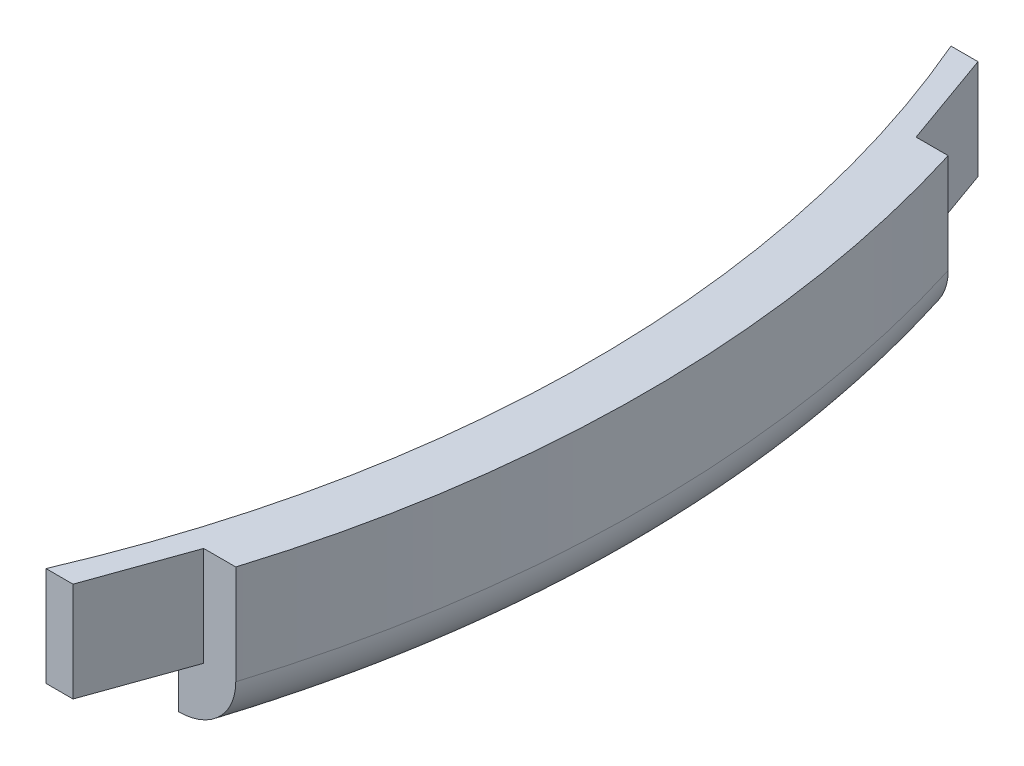
ISO-10303-21;
HEADER;
FILE_DESCRIPTION(('STEP AP214'),'2;1');
FILE_NAME('part.step','',(''),(''),'','','');
FILE_SCHEMA(('AUTOMOTIVE_DESIGN { 1 0 10303 214 1 1 1 1 }'));
ENDSEC;
DATA;
#1=APPLICATION_CONTEXT('core data for automotive mechanical design processes');
#2=APPLICATION_PROTOCOL_DEFINITION('international standard','automotive_design',2000,#1);
#3=PRODUCT_CONTEXT('',#1,'mechanical');
#4=PRODUCT('Part','Part','',(#3));
#5=PRODUCT_RELATED_PRODUCT_CATEGORY('part','',(#4));
#6=PRODUCT_DEFINITION_FORMATION('','',#4);
#7=PRODUCT_DEFINITION_CONTEXT('part definition',#1,'design');
#8=PRODUCT_DEFINITION('design','',#6,#7);
#9=PRODUCT_DEFINITION_SHAPE('','',#8);
#10=(LENGTH_UNIT() NAMED_UNIT(*) SI_UNIT(.MILLI.,.METRE.));
#11=(NAMED_UNIT(*) PLANE_ANGLE_UNIT() SI_UNIT($,.RADIAN.));
#12=(NAMED_UNIT(*) SI_UNIT($,.STERADIAN.) SOLID_ANGLE_UNIT());
#13=UNCERTAINTY_MEASURE_WITH_UNIT(LENGTH_MEASURE(1.E-05),#10,'distance_accuracy_value','');
#14=(GEOMETRIC_REPRESENTATION_CONTEXT(3) GLOBAL_UNCERTAINTY_ASSIGNED_CONTEXT((#13)) GLOBAL_UNIT_ASSIGNED_CONTEXT((#10,
#11,#12)) REPRESENTATION_CONTEXT('',''));
#15=CARTESIAN_POINT('',(0.,0.,0.));
#16=DIRECTION('',(0.,0.,1.));
#17=DIRECTION('',(1.,0.,0.));
#18=AXIS2_PLACEMENT_3D('',#15,#16,#17);
#19=CARTESIAN_POINT('',(32.9063823596578,3.6,14.1));
#20=DIRECTION('',(0.,0.,-1.));
#21=DIRECTION('',(-1.,0.,0.));
#22=AXIS2_PLACEMENT_3D('',#19,#20,#21);
#23=PLANE('',#22);
#24=DIRECTION('',(-1.,0.,0.));
#25=VECTOR('',#24,1.);
#26=CARTESIAN_POINT('',(33.7482373653686,0.5,14.1));
#27=LINE('',#26,#25);
#28=CARTESIAN_POINT('',(33.7482373653686,0.5,14.1));
#29=VERTEX_POINT('',#28);
#30=CARTESIAN_POINT('',(32.9063823596578,0.5,14.1));
#31=VERTEX_POINT('',#30);
#32=EDGE_CURVE('E134',#29,#31,#27,.T.);
#33=ORIENTED_EDGE('',*,*,#32,.F.);
#34=DIRECTION('',(0.,-1.,0.));
#35=VECTOR('',#34,1.);
#36=CARTESIAN_POINT('',(33.7482373653686,3.6,14.1));
#37=LINE('',#36,#35);
#38=CARTESIAN_POINT('',(33.7482373653686,3.6,14.1));
#39=VERTEX_POINT('',#38);
#40=EDGE_CURVE('E151',#39,#29,#37,.T.);
#41=ORIENTED_EDGE('',*,*,#40,.F.);
#42=DIRECTION('',(1.,0.,0.));
#43=VECTOR('',#42,1.);
#44=CARTESIAN_POINT('',(32.9063823596578,3.6,14.1));
#45=LINE('',#44,#43);
#46=CARTESIAN_POINT('',(32.9063823596578,3.6,14.1));
#47=VERTEX_POINT('',#46);
#48=EDGE_CURVE('E209',#47,#39,#45,.T.);
#49=ORIENTED_EDGE('',*,*,#48,.F.);
#50=DIRECTION('',(0.,-1.,0.));
#51=VECTOR('',#50,1.);
#52=CARTESIAN_POINT('',(32.9063823596578,3.6,14.1));
#53=LINE('',#52,#51);
#54=EDGE_CURVE('E154',#47,#31,#53,.T.);
#55=ORIENTED_EDGE('',*,*,#54,.T.);
#56=EDGE_LOOP('',(#33,#41,#49,#55));
#57=FACE_BOUND('',#56,.T.);
#58=ADVANCED_FACE('F34',(#57),#23,.F.);
#59=CARTESIAN_POINT('',(33.7482373653686,3.6,14.1));
#60=DIRECTION('',(-0.941753663860035,0.,-0.336303488840363));
#61=DIRECTION('',(-0.336303488840363,0.,0.941753663860035));
#62=AXIS2_PLACEMENT_3D('',#59,#60,#61);
#63=PLANE('',#62);
#64=DIRECTION('',(-0.336303488840363,0.,0.941753663860035));
#65=VECTOR('',#64,1.);
#66=CARTESIAN_POINT('',(34.8195477358383,0.5,11.1));
#67=LINE('',#66,#65);
#68=CARTESIAN_POINT('',(34.8195477358383,0.5,11.1));
#69=VERTEX_POINT('',#68);
#70=EDGE_CURVE('E199',#69,#29,#67,.T.);
#71=ORIENTED_EDGE('',*,*,#70,.F.);
#72=DIRECTION('',(0.,-1.,0.));
#73=VECTOR('',#72,1.);
#74=CARTESIAN_POINT('',(34.8195477358383,3.6,11.1));
#75=LINE('',#74,#73);
#76=CARTESIAN_POINT('',(34.8195477358383,3.6,11.1));
#77=VERTEX_POINT('',#76);
#78=EDGE_CURVE('E148',#77,#69,#75,.T.);
#79=ORIENTED_EDGE('',*,*,#78,.F.);
#80=DIRECTION('',(0.336303488840363,0.,-0.941753663860035));
#81=VECTOR('',#80,1.);
#82=CARTESIAN_POINT('',(33.7482373653686,3.6,14.1));
#83=LINE('',#82,#81);
#84=EDGE_CURVE('E211',#39,#77,#83,.T.);
#85=ORIENTED_EDGE('',*,*,#84,.F.);
#86=ORIENTED_EDGE('',*,*,#40,.T.);
#87=EDGE_LOOP('',(#71,#79,#85,#86));
#88=FACE_BOUND('',#87,.T.);
#89=ADVANCED_FACE('F171',(#88),#63,.F.);
#90=CARTESIAN_POINT('',(33.7482373653686,3.6,-14.1));
#91=DIRECTION('',(-0.941753663860035,0.,0.336303488840363));
#92=DIRECTION('',(0.336303488840363,0.,0.941753663860035));
#93=AXIS2_PLACEMENT_3D('',#90,#91,#92);
#94=PLANE('',#93);
#95=DIRECTION('',(0.336303488840363,0.,0.941753663860035));
#96=VECTOR('',#95,1.);
#97=CARTESIAN_POINT('',(33.7482373653686,0.5,-14.1));
#98=LINE('',#97,#96);
#99=CARTESIAN_POINT('',(33.7482373653686,0.5,-14.1));
#100=VERTEX_POINT('',#99);
#101=CARTESIAN_POINT('',(34.8195477358383,0.5,-11.1));
#102=VERTEX_POINT('',#101);
#103=EDGE_CURVE('E126',#100,#102,#98,.T.);
#104=ORIENTED_EDGE('',*,*,#103,.F.);
#105=DIRECTION('',(0.,-1.,0.));
#106=VECTOR('',#105,1.);
#107=CARTESIAN_POINT('',(33.7482373653686,3.6,-14.1));
#108=LINE('',#107,#106);
#109=CARTESIAN_POINT('',(33.7482373653686,3.6,-14.1));
#110=VERTEX_POINT('',#109);
#111=EDGE_CURVE('E139',#110,#100,#108,.T.);
#112=ORIENTED_EDGE('',*,*,#111,.F.);
#113=DIRECTION('',(-0.336303488840363,0.,-0.941753663860035));
#114=VECTOR('',#113,1.);
#115=CARTESIAN_POINT('',(33.7482373653686,3.6,-14.1));
#116=LINE('',#115,#114);
#117=CARTESIAN_POINT('',(34.8195477358383,3.6,-11.1));
#118=VERTEX_POINT('',#117);
#119=EDGE_CURVE('E137',#118,#110,#116,.T.);
#120=ORIENTED_EDGE('',*,*,#119,.F.);
#121=DIRECTION('',(0.,-1.,0.));
#122=VECTOR('',#121,1.);
#123=CARTESIAN_POINT('',(34.8195477358383,3.6,-11.1));
#124=LINE('',#123,#122);
#125=EDGE_CURVE('E122',#118,#102,#124,.T.);
#126=ORIENTED_EDGE('',*,*,#125,.T.);
#127=EDGE_LOOP('',(#104,#112,#120,#126));
#128=FACE_BOUND('',#127,.T.);
#129=ADVANCED_FACE('F136',(#128),#94,.F.);
#130=CARTESIAN_POINT('',(32.9063823596578,3.6,-14.1));
#131=DIRECTION('',(0.,0.,1.));
#132=DIRECTION('',(1.,0.,0.));
#133=AXIS2_PLACEMENT_3D('',#130,#131,#132);
#134=PLANE('',#133);
#135=DIRECTION('',(1.,0.,0.));
#136=VECTOR('',#135,1.);
#137=CARTESIAN_POINT('',(32.9063823596578,0.5,-14.1));
#138=LINE('',#137,#136);
#139=CARTESIAN_POINT('',(32.9063823596578,0.5,-14.1));
#140=VERTEX_POINT('',#139);
#141=EDGE_CURVE('E130',#140,#100,#138,.T.);
#142=ORIENTED_EDGE('',*,*,#141,.F.);
#143=DIRECTION('',(0.,-1.,0.));
#144=VECTOR('',#143,1.);
#145=CARTESIAN_POINT('',(32.9063823596578,3.6,-14.1));
#146=LINE('',#145,#144);
#147=CARTESIAN_POINT('',(32.9063823596578,3.6,-14.1));
#148=VERTEX_POINT('',#147);
#149=EDGE_CURVE('E143',#148,#140,#146,.T.);
#150=ORIENTED_EDGE('',*,*,#149,.F.);
#151=DIRECTION('',(-1.,0.,0.));
#152=VECTOR('',#151,1.);
#153=CARTESIAN_POINT('',(32.9063823596578,3.6,-14.1));
#154=LINE('',#153,#152);
#155=EDGE_CURVE('E220',#110,#148,#154,.T.);
#156=ORIENTED_EDGE('',*,*,#155,.F.);
#157=ORIENTED_EDGE('',*,*,#111,.T.);
#158=EDGE_LOOP('',(#142,#150,#156,#157));
#159=FACE_BOUND('',#158,.T.);
#160=ADVANCED_FACE('F178',(#159),#134,.F.);
#161=CARTESIAN_POINT('',(0.,3.6,0.));
#162=DIRECTION('',(0.,-1.,0.));
#163=DIRECTION('',(0.,0.,-1.));
#164=AXIS2_PLACEMENT_3D('',#161,#162,#163);
#165=CYLINDRICAL_SURFACE('',#164,35.8);
#166=CARTESIAN_POINT('',(0.,0.5,0.));
#167=DIRECTION('',(0.,1.,0.));
#168=DIRECTION('',(0.,0.,-1.));
#169=AXIS2_PLACEMENT_3D('',#166,#167,#168);
#170=CIRCLE('',#169,35.8);
#171=CARTESIAN_POINT('',(34.0357165342527,0.5,-11.1));
#172=VERTEX_POINT('',#171);
#173=EDGE_CURVE('E55',#172,#140,#170,.T.);
#174=ORIENTED_EDGE('',*,*,#173,.F.);
#175=DIRECTION('',(0.,1.,0.));
#176=VECTOR('',#175,1.);
#177=CARTESIAN_POINT('',(34.0357165342527,-1.2,-11.1));
#178=LINE('',#177,#176);
#179=CARTESIAN_POINT('',(34.0357165342527,-1.2,-11.1));
#180=VERTEX_POINT('',#179);
#181=EDGE_CURVE('E125',#180,#172,#178,.T.);
#182=ORIENTED_EDGE('',*,*,#181,.F.);
#183=CARTESIAN_POINT('',(0.,-1.2,0.));
#184=DIRECTION('',(0.,1.,0.));
#185=DIRECTION('',(0.,0.,-1.));
#186=AXIS2_PLACEMENT_3D('',#183,#184,#185);
#187=CIRCLE('',#186,35.8);
#188=CARTESIAN_POINT('',(34.0357165342527,-1.2,11.1));
#189=VERTEX_POINT('',#188);
#190=EDGE_CURVE('E191',#189,#180,#187,.T.);
#191=ORIENTED_EDGE('',*,*,#190,.F.);
#192=DIRECTION('',(0.,1.,0.));
#193=VECTOR('',#192,1.);
#194=CARTESIAN_POINT('',(34.0357165342527,-1.2,11.1));
#195=LINE('',#194,#193);
#196=CARTESIAN_POINT('',(34.0357165342527,0.5,11.1));
#197=VERTEX_POINT('',#196);
#198=EDGE_CURVE('E204',#189,#197,#195,.T.);
#199=ORIENTED_EDGE('',*,*,#198,.T.);
#200=CARTESIAN_POINT('',(0.,0.5,0.));
#201=DIRECTION('',(0.,1.,0.));
#202=DIRECTION('',(0.,0.,-1.));
#203=AXIS2_PLACEMENT_3D('',#200,#201,#202);
#204=CIRCLE('',#203,35.8);
#205=EDGE_CURVE('E194',#31,#197,#204,.T.);
#206=ORIENTED_EDGE('',*,*,#205,.F.);
#207=ORIENTED_EDGE('',*,*,#54,.F.);
#208=CARTESIAN_POINT('',(0.,3.6,0.));
#209=DIRECTION('',(0.,-1.,0.));
#210=DIRECTION('',(0.,0.,1.));
#211=AXIS2_PLACEMENT_3D('',#208,#209,#210);
#212=CIRCLE('',#211,35.8);
#213=EDGE_CURVE('E206',#148,#47,#212,.T.);
#214=ORIENTED_EDGE('',*,*,#213,.F.);
#215=ORIENTED_EDGE('',*,*,#149,.T.);
#216=EDGE_LOOP('',(#174,#182,#191,#199,#206,#207,#214,#215));
#217=FACE_BOUND('',#216,.T.);
#218=ADVANCED_FACE('F169',(#217),#165,.F.);
#219=CARTESIAN_POINT('',(34.8195477358383,3.6,11.1));
#220=DIRECTION('',(0.,0.,-1.));
#221=DIRECTION('',(-1.,0.,0.));
#222=AXIS2_PLACEMENT_3D('',#219,#220,#221);
#223=PLANE('',#222);
#224=ORIENTED_EDGE('',*,*,#198,.F.);
#225=CARTESIAN_POINT('',(34.0357165342526,-1.2,11.1));
#226=CARTESIAN_POINT('',(34.0878312953367,-1.19999826312588,11.1));
#227=CARTESIAN_POINT('',(34.1399220625707,-1.19783268353864,11.1));
#228=CARTESIAN_POINT('',(34.2437468183493,-1.18917814890255,11.1));
#229=CARTESIAN_POINT('',(34.2954807799685,-1.1826888711068,11.1));
#230=CARTESIAN_POINT('',(34.449667152995,-1.15674334140389,11.1));
#231=CARTESIAN_POINT('',(34.5511095381115,-1.13080939204675,11.1));
#232=CARTESIAN_POINT('',(34.748222377693,-1.0621334166199,11.1));
#233=CARTESIAN_POINT('',(34.8438864003516,-1.01937304499942,11.1));
#234=CARTESIAN_POINT('',(35.0263651319531,-0.91798268297746,11.1));
#235=CARTESIAN_POINT('',(35.113185659679,-0.859363221497624,11.1));
#236=CARTESIAN_POINT('',(35.272912900213,-0.729462646685788,11.1));
#237=CARTESIAN_POINT('',(35.3461317624666,-0.658565734699347,11.1));
#238=CARTESIAN_POINT('',(35.478936830974,-0.504926230735661,11.1));
#239=CARTESIAN_POINT('',(35.5385220796713,-0.422182807382184,11.1));
#240=CARTESIAN_POINT('',(35.63937877486,-0.251377432106678,11.1));
#241=CARTESIAN_POINT('',(35.6813723932254,-0.163741111313373,11.1));
#242=CARTESIAN_POINT('',(35.7493137292622,0.0174928970237205,11.1));
#243=CARTESIAN_POINT('',(35.7752820103001,0.111082774176225,11.1));
#244=CARTESIAN_POINT('',(35.8016678072496,0.25462350501689,11.1));
#245=CARTESIAN_POINT('',(35.8083701964445,0.303494411188987,11.1));
#246=CARTESIAN_POINT('',(35.8173073891199,0.401568419647788,11.1));
#247=CARTESIAN_POINT('',(35.8195489312021,0.450770908043001,11.1));
#248=CARTESIAN_POINT('',(35.8195477358383,0.499999999999997,11.1));
#249=B_SPLINE_CURVE_WITH_KNOTS('',3,(#225,#226,#227,#228,#229,#230,#231,#232,#233,#234,#235,
#236,#237,#238,#239,#240,#241,#242,#243,#244,#245,#246,#247,#248),.UNSPECIFIED.,.F.,.F.,(4,2,2,
2,2,2,2,2,2,2,2,4),(0.,0.156250994084832,0.312513652992492,0.62502271903289,0.937873456449133,
1.25051699838773,1.55472700450987,1.85895837025808,2.14905683093386,2.43878226526576,
2.58658961934673,2.73417352411161),.UNSPECIFIED.);
#250=CARTESIAN_POINT('',(35.8195477358383,0.5,11.1));
#251=VERTEX_POINT('',#250);
#252=EDGE_CURVE('E157',#189,#251,#249,.T.);
#253=ORIENTED_EDGE('',*,*,#252,.T.);
#254=DIRECTION('',(0.,-1.,0.));
#255=VECTOR('',#254,1.);
#256=CARTESIAN_POINT('',(35.8195477358383,3.6,11.1));
#257=LINE('',#256,#255);
#258=CARTESIAN_POINT('',(35.8195477358383,3.6,11.1));
#259=VERTEX_POINT('',#258);
#260=EDGE_CURVE('E141',#259,#251,#257,.T.);
#261=ORIENTED_EDGE('',*,*,#260,.F.);
#262=DIRECTION('',(1.,0.,0.));
#263=VECTOR('',#262,1.);
#264=CARTESIAN_POINT('',(34.8195477358383,3.6,11.1));
#265=LINE('',#264,#263);
#266=EDGE_CURVE('E213',#77,#259,#265,.T.);
#267=ORIENTED_EDGE('',*,*,#266,.F.);
#268=ORIENTED_EDGE('',*,*,#78,.T.);
#269=DIRECTION('',(1.,0.,0.));
#270=VECTOR('',#269,1.);
#271=CARTESIAN_POINT('',(34.0357165342527,0.5,11.1));
#272=LINE('',#271,#270);
#273=EDGE_CURVE('E197',#197,#69,#272,.T.);
#274=ORIENTED_EDGE('',*,*,#273,.F.);
#275=EDGE_LOOP('',(#224,#253,#261,#267,#268,#274));
#276=FACE_BOUND('',#275,.T.);
#277=ADVANCED_FACE('F163',(#276),#223,.F.);
#278=CARTESIAN_POINT('',(0.,3.6,0.));
#279=DIRECTION('',(0.,-1.,0.));
#280=DIRECTION('',(0.,0.,-1.));
#281=AXIS2_PLACEMENT_3D('',#278,#279,#280);
#282=CYLINDRICAL_SURFACE('',#281,37.5);
#283=ORIENTED_EDGE('',*,*,#260,.T.);
#284=CARTESIAN_POINT('',(0.,0.5,0.));
#285=DIRECTION('',(0.,-1.,0.));
#286=DIRECTION('',(0.,0.,-1.));
#287=AXIS2_PLACEMENT_3D('',#284,#285,#286);
#288=CIRCLE('',#287,37.5);
#289=CARTESIAN_POINT('',(35.8195477358383,0.5,-11.1));
#290=VERTEX_POINT('',#289);
#291=EDGE_CURVE('E48',#251,#290,#288,.F.);
#292=ORIENTED_EDGE('',*,*,#291,.T.);
#293=DIRECTION('',(0.,-1.,0.));
#294=VECTOR('',#293,1.);
#295=CARTESIAN_POINT('',(35.8195477358383,3.6,-11.1));
#296=LINE('',#295,#294);
#297=CARTESIAN_POINT('',(35.8195477358383,3.6,-11.1));
#298=VERTEX_POINT('',#297);
#299=EDGE_CURVE('E138',#298,#290,#296,.T.);
#300=ORIENTED_EDGE('',*,*,#299,.F.);
#301=CARTESIAN_POINT('',(0.,3.6,0.));
#302=DIRECTION('',(0.,1.,0.));
#303=DIRECTION('',(0.,0.,1.));
#304=AXIS2_PLACEMENT_3D('',#301,#302,#303);
#305=CIRCLE('',#304,37.5);
#306=EDGE_CURVE('E215',#259,#298,#305,.T.);
#307=ORIENTED_EDGE('',*,*,#306,.F.);
#308=EDGE_LOOP('',(#283,#292,#300,#307));
#309=FACE_BOUND('',#308,.T.);
#310=ADVANCED_FACE('F168',(#309),#282,.T.);
#311=CARTESIAN_POINT('',(34.8195477358383,3.6,-11.1));
#312=DIRECTION('',(0.,0.,1.));
#313=DIRECTION('',(1.,0.,0.));
#314=AXIS2_PLACEMENT_3D('',#311,#312,#313);
#315=PLANE('',#314);
#316=ORIENTED_EDGE('',*,*,#299,.T.);
#317=CARTESIAN_POINT('',(35.8195477358383,0.5,-11.1));
#318=CARTESIAN_POINT('',(35.8195484921704,0.453742317812802,-11.1));
#319=CARTESIAN_POINT('',(35.8175697940253,0.407507342857407,-11.1));
#320=CARTESIAN_POINT('',(35.8096832333119,0.315379942667947,-11.1));
#321=CARTESIAN_POINT('',(35.8037759002646,0.269487472112296,-11.1));
#322=CARTESIAN_POINT('',(35.7802493318638,0.133009284830924,-11.1));
#323=CARTESIAN_POINT('',(35.756825134338,0.0433570533621992,-11.1));
#324=CARTESIAN_POINT('',(35.695310935509,-0.130707102248363,-11.1));
#325=CARTESIAN_POINT('',(35.6572200693198,-0.21511871701281,-11.1));
#326=CARTESIAN_POINT('',(35.5676537697212,-0.376525969900883,-11.1));
#327=CARTESIAN_POINT('',(35.5161761357038,-0.453520385880495,-11.1));
#328=CARTESIAN_POINT('',(35.4004138112373,-0.59950949625037,-11.1));
#329=CARTESIAN_POINT('',(35.335910357281,-0.668330390232476,-11.1));
#330=CARTESIAN_POINT('',(35.1966818559328,-0.794710348001185,-11.1));
#331=CARTESIAN_POINT('',(35.1219544347027,-0.852266788800437,-11.1));
#332=CARTESIAN_POINT('',(34.9610256766971,-0.957103053048923,-11.1));
#333=CARTESIAN_POINT('',(34.8744708226957,-1.00383962735632,-11.1));
#334=CARTESIAN_POINT('',(34.6949776497104,-1.0828205844793,-11.1));
#335=CARTESIAN_POINT('',(34.6020386772192,-1.11506348110013,-11.1));
#336=CARTESIAN_POINT('',(34.430235882658,-1.15979997263521,-11.1));
#337=CARTESIAN_POINT('',(34.3520309338222,-1.1748741509771,-11.1));
#338=CARTESIAN_POINT('',(34.1944599235052,-1.19497446711132,-11.1));
#339=CARTESIAN_POINT('',(34.1150958025985,-1.20001580732983,-11.1));
#340=CARTESIAN_POINT('',(34.0357165342526,-1.2,-11.1));
#341=B_SPLINE_CURVE_WITH_KNOTS('',3,(#317,#318,#319,#320,#321,#322,#323,#324,#325,#326,#327,
#328,#329,#330,#331,#332,#333,#334,#335,#336,#337,#338,#339,#340),.UNSPECIFIED.,.F.,.F.,(4,2,2,
2,2,2,2,2,2,2,2,4),(0.,0.138685934026875,0.277353179063261,0.553900816620027,0.830464764545443,
1.10707420470113,1.38878699852757,1.67056531281936,1.9643662025093,2.25819721193841,
2.49650527572795,2.73445196344932),.UNSPECIFIED.);
#342=EDGE_CURVE('E11',#290,#180,#341,.T.);
#343=ORIENTED_EDGE('',*,*,#342,.T.);
#344=ORIENTED_EDGE('',*,*,#181,.T.);
#345=DIRECTION('',(-1.,0.,0.));
#346=VECTOR('',#345,1.);
#347=CARTESIAN_POINT('',(34.8195477358383,0.5,-11.1));
#348=LINE('',#347,#346);
#349=EDGE_CURVE('E117',#102,#172,#348,.T.);
#350=ORIENTED_EDGE('',*,*,#349,.F.);
#351=ORIENTED_EDGE('',*,*,#125,.F.);
#352=DIRECTION('',(-1.,0.,0.));
#353=VECTOR('',#352,1.);
#354=CARTESIAN_POINT('',(34.8195477358383,3.6,-11.1));
#355=LINE('',#354,#353);
#356=EDGE_CURVE('E217',#298,#118,#355,.T.);
#357=ORIENTED_EDGE('',*,*,#356,.F.);
#358=EDGE_LOOP('',(#316,#343,#344,#350,#351,#357));
#359=FACE_BOUND('',#358,.T.);
#360=ADVANCED_FACE('F119',(#359),#315,.F.);
#361=CARTESIAN_POINT('',(0.,3.6,0.));
#362=DIRECTION('',(0.,1.,0.));
#363=DIRECTION('',(0.,0.,1.));
#364=AXIS2_PLACEMENT_3D('',#361,#362,#363);
#365=PLANE('',#364);
#366=ORIENTED_EDGE('',*,*,#213,.T.);
#367=ORIENTED_EDGE('',*,*,#48,.T.);
#368=ORIENTED_EDGE('',*,*,#84,.T.);
#369=ORIENTED_EDGE('',*,*,#266,.T.);
#370=ORIENTED_EDGE('',*,*,#306,.T.);
#371=ORIENTED_EDGE('',*,*,#356,.T.);
#372=ORIENTED_EDGE('',*,*,#119,.T.);
#373=ORIENTED_EDGE('',*,*,#155,.T.);
#374=EDGE_LOOP('',(#366,#367,#368,#369,#370,#371,#372,#373));
#375=FACE_BOUND('',#374,.T.);
#376=ADVANCED_FACE('F223',(#375),#365,.T.);
#377=CARTESIAN_POINT('',(0.,0.5,0.));
#378=DIRECTION('',(0.,-1.,0.));
#379=DIRECTION('',(0.,0.,-1.));
#380=AXIS2_PLACEMENT_3D('',#377,#378,#379);
#381=TOROIDAL_SURFACE('',#380,35.8,1.7);
#382=ORIENTED_EDGE('',*,*,#342,.F.);
#383=ORIENTED_EDGE('',*,*,#291,.F.);
#384=ORIENTED_EDGE('',*,*,#252,.F.);
#385=ORIENTED_EDGE('',*,*,#190,.T.);
#386=EDGE_LOOP('',(#382,#383,#384,#385));
#387=FACE_BOUND('',#386,.T.);
#388=ADVANCED_FACE('F36',(#387),#381,.T.);
#389=CARTESIAN_POINT('',(0.,0.5,0.));
#390=DIRECTION('',(0.,-1.,0.));
#391=DIRECTION('',(0.,0.,-1.));
#392=AXIS2_PLACEMENT_3D('',#389,#390,#391);
#393=PLANE('',#392);
#394=ORIENTED_EDGE('',*,*,#103,.T.);
#395=ORIENTED_EDGE('',*,*,#349,.T.);
#396=ORIENTED_EDGE('',*,*,#173,.T.);
#397=ORIENTED_EDGE('',*,*,#141,.T.);
#398=EDGE_LOOP('',(#394,#395,#396,#397));
#399=FACE_BOUND('',#398,.T.);
#400=ADVANCED_FACE('F129',(#399),#393,.T.);
#401=CARTESIAN_POINT('',(0.,0.5,0.));
#402=DIRECTION('',(0.,-1.,0.));
#403=DIRECTION('',(0.,0.,-1.));
#404=AXIS2_PLACEMENT_3D('',#401,#402,#403);
#405=PLANE('',#404);
#406=ORIENTED_EDGE('',*,*,#205,.T.);
#407=ORIENTED_EDGE('',*,*,#273,.T.);
#408=ORIENTED_EDGE('',*,*,#70,.T.);
#409=ORIENTED_EDGE('',*,*,#32,.T.);
#410=EDGE_LOOP('',(#406,#407,#408,#409));
#411=FACE_BOUND('',#410,.T.);
#412=ADVANCED_FACE('F239',(#411),#405,.T.);
#413=CLOSED_SHELL('',(#58,#89,#129,#160,#218,#277,#310,#360,#376,#388,#400,#412));
#414=MANIFOLD_SOLID_BREP('B2',#413);
#415=ADVANCED_BREP_SHAPE_REPRESENTATION('',(#18,#414),#14);
#416=SHAPE_DEFINITION_REPRESENTATION(#9,#415);
ENDSEC;
END-ISO-10303-21;
